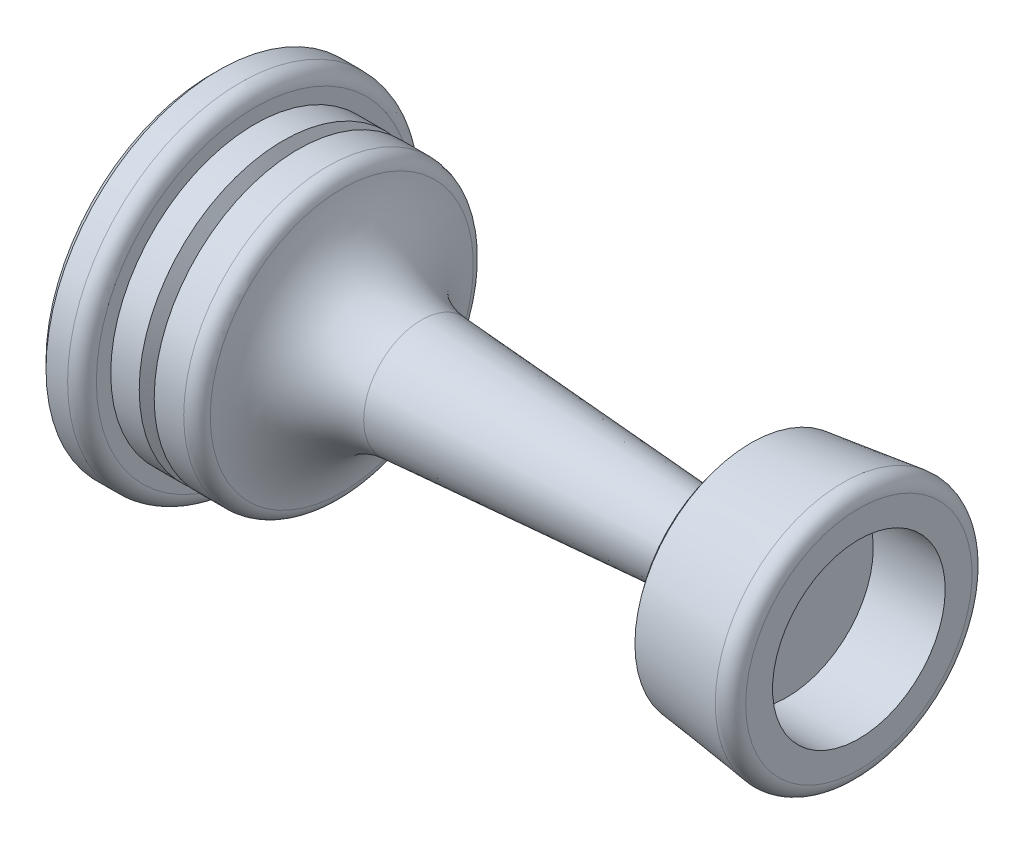
ISO-10303-21;
HEADER;
FILE_DESCRIPTION(('STEP AP214'),'2;1');
FILE_NAME('part.step','',(''),(''),'','','');
FILE_SCHEMA(('AUTOMOTIVE_DESIGN { 1 0 10303 214 1 1 1 1 }'));
ENDSEC;
DATA;
#1=APPLICATION_CONTEXT('core data for automotive mechanical design processes');
#2=APPLICATION_PROTOCOL_DEFINITION('international standard','automotive_design',2000,#1);
#3=PRODUCT_CONTEXT('',#1,'mechanical');
#4=PRODUCT('Part','Part','',(#3));
#5=PRODUCT_RELATED_PRODUCT_CATEGORY('part','',(#4));
#6=PRODUCT_DEFINITION_FORMATION('','',#4);
#7=PRODUCT_DEFINITION_CONTEXT('part definition',#1,'design');
#8=PRODUCT_DEFINITION('design','',#6,#7);
#9=PRODUCT_DEFINITION_SHAPE('','',#8);
#10=(LENGTH_UNIT() NAMED_UNIT(*) SI_UNIT(.MILLI.,.METRE.));
#11=(NAMED_UNIT(*) PLANE_ANGLE_UNIT() SI_UNIT($,.RADIAN.));
#12=(NAMED_UNIT(*) SI_UNIT($,.STERADIAN.) SOLID_ANGLE_UNIT());
#13=UNCERTAINTY_MEASURE_WITH_UNIT(LENGTH_MEASURE(1.E-05),#10,'distance_accuracy_value','');
#14=(GEOMETRIC_REPRESENTATION_CONTEXT(3) GLOBAL_UNCERTAINTY_ASSIGNED_CONTEXT((#13)) GLOBAL_UNIT_ASSIGNED_CONTEXT((#10,
#11,#12)) REPRESENTATION_CONTEXT('',''));
#15=CARTESIAN_POINT('',(0.,0.,0.));
#16=DIRECTION('',(0.,0.,1.));
#17=DIRECTION('',(1.,0.,0.));
#18=AXIS2_PLACEMENT_3D('',#15,#16,#17);
#19=CARTESIAN_POINT('',(0.,0.,0.));
#20=DIRECTION('',(-1.,0.,0.));
#21=DIRECTION('',(0.,0.,1.));
#22=AXIS2_PLACEMENT_3D('',#19,#20,#21);
#23=CYLINDRICAL_SURFACE('',#22,10.);
#24=CARTESIAN_POINT('',(8.07179676972449,0.,0.));
#25=DIRECTION('',(-1.,0.,0.));
#26=DIRECTION('',(0.,0.,1.));
#27=AXIS2_PLACEMENT_3D('',#24,#25,#26);
#28=CIRCLE('',#27,10.);
#29=CARTESIAN_POINT('',(8.07179676972449,0.,10.));
#30=VERTEX_POINT('',#29);
#31=EDGE_CURVE('E61',#30,#30,#28,.T.);
#32=ORIENTED_EDGE('',*,*,#31,.T.);
#33=EDGE_LOOP('',(#32));
#34=FACE_BOUND('',#33,.T.);
#35=CARTESIAN_POINT('',(6.02056705055174,0.,0.));
#36=DIRECTION('',(-1.,0.,0.));
#37=DIRECTION('',(0.,0.,1.));
#38=AXIS2_PLACEMENT_3D('',#35,#36,#37);
#39=CIRCLE('',#38,10.);
#40=CARTESIAN_POINT('',(6.02056705055174,0.,10.));
#41=VERTEX_POINT('',#40);
#42=EDGE_CURVE('E85',#41,#41,#39,.T.);
#43=ORIENTED_EDGE('',*,*,#42,.F.);
#44=EDGE_LOOP('',(#43));
#45=FACE_BOUND('',#44,.T.);
#46=ADVANCED_FACE('F32',(#34,#45),#23,.T.);
#47=CARTESIAN_POINT('',(45.,9.,0.));
#48=DIRECTION('',(-1.,0.,0.));
#49=DIRECTION('',(0.,0.,1.));
#50=AXIS2_PLACEMENT_3D('',#47,#48,#49);
#51=PLANE('',#50);
#52=CARTESIAN_POINT('',(45.,0.,0.));
#53=DIRECTION('',(-1.,0.,0.));
#54=DIRECTION('',(0.,0.,1.));
#55=AXIS2_PLACEMENT_3D('',#52,#53,#54);
#56=CIRCLE('',#55,7.86721778146268);
#57=CARTESIAN_POINT('',(45.,0.,7.86721778146268));
#58=VERTEX_POINT('',#57);
#59=EDGE_CURVE('E43',#58,#58,#56,.F.);
#60=ORIENTED_EDGE('',*,*,#59,.T.);
#61=EDGE_LOOP('',(#60));
#62=FACE_BOUND('',#61,.T.);
#63=CARTESIAN_POINT('',(45.,0.,0.));
#64=DIRECTION('',(1.,0.,0.));
#65=DIRECTION('',(0.,0.,-1.));
#66=AXIS2_PLACEMENT_3D('',#63,#64,#65);
#67=CIRCLE('',#66,6.);
#68=CARTESIAN_POINT('',(45.,0.,-6.));
#69=VERTEX_POINT('',#68);
#70=EDGE_CURVE('E95',#69,#69,#67,.T.);
#71=ORIENTED_EDGE('',*,*,#70,.F.);
#72=EDGE_LOOP('',(#71));
#73=FACE_BOUND('',#72,.T.);
#74=ADVANCED_FACE('F110',(#62,#73),#51,.F.);
#75=CARTESIAN_POINT('',(45.,0.,0.));
#76=DIRECTION('',(1.,0.,0.));
#77=DIRECTION('',(0.,0.,-1.));
#78=AXIS2_PLACEMENT_3D('',#75,#76,#77);
#79=CONICAL_SURFACE('',#78,9.,0.124354994546761);
#80=CARTESIAN_POINT('',(37.4961389383569,0.,0.));
#81=DIRECTION('',(-1.,0.,0.));
#82=DIRECTION('',(0.,0.,1.));
#83=AXIS2_PLACEMENT_3D('',#80,#81,#82);
#84=CIRCLE('',#83,8.06201736729461);
#85=CARTESIAN_POINT('',(37.4961389383569,0.,8.06201736729461));
#86=VERTEX_POINT('',#85);
#87=EDGE_CURVE('E10',#86,#86,#84,.F.);
#88=ORIENTED_EDGE('',*,*,#87,.T.);
#89=EDGE_LOOP('',(#88));
#90=FACE_BOUND('',#89,.T.);
#91=CARTESIAN_POINT('',(43.8759652654108,0.,0.));
#92=DIRECTION('',(-1.,0.,0.));
#93=DIRECTION('',(0.,0.,1.));
#94=AXIS2_PLACEMENT_3D('',#91,#92,#93);
#95=CIRCLE('',#94,8.85949565817635);
#96=CARTESIAN_POINT('',(43.8759652654108,0.,8.85949565817635));
#97=VERTEX_POINT('',#96);
#98=EDGE_CURVE('E47',#97,#97,#95,.T.);
#99=ORIENTED_EDGE('',*,*,#98,.T.);
#100=EDGE_LOOP('',(#99));
#101=FACE_BOUND('',#100,.T.);
#102=ADVANCED_FACE('F112',(#90,#101),#79,.T.);
#103=CARTESIAN_POINT('',(37.,2.5,0.));
#104=DIRECTION('',(1.,0.,0.));
#105=DIRECTION('',(0.,0.,-1.));
#106=AXIS2_PLACEMENT_3D('',#103,#104,#105);
#107=PLANE('',#106);
#108=CARTESIAN_POINT('',(37.,0.,0.));
#109=DIRECTION('',(1.,0.,0.));
#110=DIRECTION('',(0.,0.,-1.));
#111=AXIS2_PLACEMENT_3D('',#108,#109,#110);
#112=CIRCLE('',#111,7.42412444655009);
#113=CARTESIAN_POINT('',(37.,0.,-7.42412444655009));
#114=VERTEX_POINT('',#113);
#115=EDGE_CURVE('E39',#114,#114,#112,.F.);
#116=ORIENTED_EDGE('',*,*,#115,.T.);
#117=EDGE_LOOP('',(#116));
#118=FACE_BOUND('',#117,.T.);
#119=CARTESIAN_POINT('',(37.,0.,0.));
#120=DIRECTION('',(-1.,0.,0.));
#121=DIRECTION('',(0.,0.,1.));
#122=AXIS2_PLACEMENT_3D('',#119,#120,#121);
#123=CIRCLE('',#122,2.5);
#124=CARTESIAN_POINT('',(37.,0.,2.5));
#125=VERTEX_POINT('',#124);
#126=EDGE_CURVE('E52',#125,#125,#123,.T.);
#127=ORIENTED_EDGE('',*,*,#126,.F.);
#128=EDGE_LOOP('',(#127));
#129=FACE_BOUND('',#128,.T.);
#130=ADVANCED_FACE('F119',(#118,#129),#107,.F.);
#131=CARTESIAN_POINT('',(37.,0.,0.));
#132=DIRECTION('',(-1.,0.,0.));
#133=DIRECTION('',(0.,0.,1.));
#134=AXIS2_PLACEMENT_3D('',#131,#132,#133);
#135=CONICAL_SURFACE('',#134,2.5,0.0674576036926157);
#136=CARTESIAN_POINT('',(14.595561275743,0.,0.));
#137=DIRECTION('',(-1.,0.,0.));
#138=DIRECTION('',(0.,0.,1.));
#139=AXIS2_PLACEMENT_3D('',#136,#137,#138);
#140=CIRCLE('',#139,4.01364640884609);
#141=CARTESIAN_POINT('',(14.595561275743,0.,4.01364640884609));
#142=VERTEX_POINT('',#141);
#143=EDGE_CURVE('E55',#142,#142,#140,.T.);
#144=ORIENTED_EDGE('',*,*,#143,.F.);
#145=EDGE_LOOP('',(#144));
#146=FACE_BOUND('',#145,.T.);
#147=ORIENTED_EDGE('',*,*,#126,.T.);
#148=EDGE_LOOP('',(#147));
#149=FACE_BOUND('',#148,.T.);
#150=ADVANCED_FACE('F185',(#146,#149),#135,.T.);
#151=CARTESIAN_POINT('',(15.,0.,0.));
#152=DIRECTION('',(-1.,0.,0.));
#153=DIRECTION('',(0.,0.,1.));
#154=AXIS2_PLACEMENT_3D('',#151,#152,#153);
#155=TOROIDAL_SURFACE('',#154,10.,6.);
#156=CARTESIAN_POINT('',(9.06154008833528,0.,0.));
#157=DIRECTION('',(-1.,0.,0.));
#158=DIRECTION('',(0.,0.,1.));
#159=AXIS2_PLACEMENT_3D('',#156,#157,#158);
#160=CIRCLE('',#159,9.14285714285714);
#161=CARTESIAN_POINT('',(9.06154008833528,0.,9.14285714285714));
#162=VERTEX_POINT('',#161);
#163=EDGE_CURVE('E58',#162,#162,#160,.T.);
#164=ORIENTED_EDGE('',*,*,#163,.F.);
#165=EDGE_LOOP('',(#164));
#166=FACE_BOUND('',#165,.T.);
#167=ORIENTED_EDGE('',*,*,#143,.T.);
#168=EDGE_LOOP('',(#167));
#169=FACE_BOUND('',#168,.T.);
#170=ADVANCED_FACE('F181',(#166,#169),#155,.F.);
#171=CARTESIAN_POINT('',(8.07179676972449,0.,0.));
#172=DIRECTION('',(-1.,0.,0.));
#173=DIRECTION('',(0.,0.,1.));
#174=AXIS2_PLACEMENT_3D('',#171,#172,#173);
#175=TOROIDAL_SURFACE('',#174,9.,1.);
#176=ORIENTED_EDGE('',*,*,#31,.F.);
#177=EDGE_LOOP('',(#176));
#178=FACE_BOUND('',#177,.T.);
#179=ORIENTED_EDGE('',*,*,#163,.T.);
#180=EDGE_LOOP('',(#179));
#181=FACE_BOUND('',#180,.T.);
#182=ADVANCED_FACE('F156',(#178,#181),#175,.T.);
#183=CARTESIAN_POINT('',(4.97943294944826,0.,0.));
#184=DIRECTION('',(-1.,0.,0.));
#185=DIRECTION('',(0.,0.,1.));
#186=AXIS2_PLACEMENT_3D('',#183,#184,#185);
#187=CONICAL_SURFACE('',#186,10.,1.09083078249646);
#188=CARTESIAN_POINT('',(5.5,0.,0.));
#189=DIRECTION('',(-1.,0.,0.));
#190=DIRECTION('',(0.,0.,1.));
#191=AXIS2_PLACEMENT_3D('',#188,#189,#190);
#192=CIRCLE('',#191,9.);
#193=CARTESIAN_POINT('',(5.5,0.,9.));
#194=VERTEX_POINT('',#193);
#195=EDGE_CURVE('E82',#194,#194,#192,.T.);
#196=ORIENTED_EDGE('',*,*,#195,.T.);
#197=EDGE_LOOP('',(#196));
#198=FACE_BOUND('',#197,.T.);
#199=CARTESIAN_POINT('',(4.97943294944826,0.,0.));
#200=DIRECTION('',(-1.,0.,0.));
#201=DIRECTION('',(0.,0.,1.));
#202=AXIS2_PLACEMENT_3D('',#199,#200,#201);
#203=CIRCLE('',#202,10.);
#204=CARTESIAN_POINT('',(4.97943294944826,0.,10.));
#205=VERTEX_POINT('',#204);
#206=EDGE_CURVE('E79',#205,#205,#203,.T.);
#207=ORIENTED_EDGE('',*,*,#206,.F.);
#208=EDGE_LOOP('',(#207));
#209=FACE_BOUND('',#208,.T.);
#210=ADVANCED_FACE('F152',(#198,#209),#187,.T.);
#211=CARTESIAN_POINT('',(5.5,0.,0.));
#212=DIRECTION('',(1.,0.,0.));
#213=DIRECTION('',(0.,0.,-1.));
#214=AXIS2_PLACEMENT_3D('',#211,#212,#213);
#215=CONICAL_SURFACE('',#214,9.,1.09083078249646);
#216=ORIENTED_EDGE('',*,*,#42,.T.);
#217=EDGE_LOOP('',(#216));
#218=FACE_BOUND('',#217,.T.);
#219=ORIENTED_EDGE('',*,*,#195,.F.);
#220=EDGE_LOOP('',(#219));
#221=FACE_BOUND('',#220,.T.);
#222=ADVANCED_FACE('F148',(#218,#221),#215,.T.);
#223=CARTESIAN_POINT('',(0.,0.,0.));
#224=DIRECTION('',(1.,0.,0.));
#225=DIRECTION('',(0.,0.,-1.));
#226=AXIS2_PLACEMENT_3D('',#223,#224,#225);
#227=PLANE('',#226);
#228=CARTESIAN_POINT('',(0.,0.,0.));
#229=DIRECTION('',(-1.,0.,0.));
#230=DIRECTION('',(0.,-1.,0.));
#231=AXIS2_PLACEMENT_3D('',#228,#229,#230);
#232=CIRCLE('',#231,6.);
#233=CARTESIAN_POINT('',(0.,-6.,0.));
#234=VERTEX_POINT('',#233);
#235=EDGE_CURVE('E89',#234,#234,#232,.T.);
#236=ORIENTED_EDGE('',*,*,#235,.F.);
#237=EDGE_LOOP('',(#236));
#238=FACE_BOUND('',#237,.T.);
#239=CARTESIAN_POINT('',(0.,0.,0.));
#240=DIRECTION('',(-1.,0.,0.));
#241=DIRECTION('',(0.,0.,1.));
#242=AXIS2_PLACEMENT_3D('',#239,#240,#241);
#243=CIRCLE('',#242,11.5);
#244=CARTESIAN_POINT('',(0.,0.,11.5));
#245=VERTEX_POINT('',#244);
#246=EDGE_CURVE('E76',#245,#245,#243,.T.);
#247=ORIENTED_EDGE('',*,*,#246,.T.);
#248=EDGE_LOOP('',(#247));
#249=FACE_BOUND('',#248,.T.);
#250=ADVANCED_FACE('F151',(#238,#249),#227,.F.);
#251=CARTESIAN_POINT('',(0.5,0.,0.));
#252=DIRECTION('',(1.,0.,0.));
#253=DIRECTION('',(0.,0.,-1.));
#254=AXIS2_PLACEMENT_3D('',#251,#252,#253);
#255=CONICAL_SURFACE('',#254,12.,0.785398163397449);
#256=ORIENTED_EDGE('',*,*,#246,.F.);
#257=EDGE_LOOP('',(#256));
#258=FACE_BOUND('',#257,.T.);
#259=CARTESIAN_POINT('',(0.5,0.,0.));
#260=DIRECTION('',(-1.,0.,0.));
#261=DIRECTION('',(0.,0.,1.));
#262=AXIS2_PLACEMENT_3D('',#259,#260,#261);
#263=CIRCLE('',#262,12.);
#264=CARTESIAN_POINT('',(0.5,0.,12.));
#265=VERTEX_POINT('',#264);
#266=EDGE_CURVE('E73',#265,#265,#263,.T.);
#267=ORIENTED_EDGE('',*,*,#266,.T.);
#268=EDGE_LOOP('',(#267));
#269=FACE_BOUND('',#268,.T.);
#270=ADVANCED_FACE('F160',(#258,#269),#255,.T.);
#271=CARTESIAN_POINT('',(0.,0.,0.));
#272=DIRECTION('',(-1.,0.,0.));
#273=DIRECTION('',(0.,0.,1.));
#274=AXIS2_PLACEMENT_3D('',#271,#272,#273);
#275=CYLINDRICAL_SURFACE('',#274,12.);
#276=ORIENTED_EDGE('',*,*,#266,.F.);
#277=EDGE_LOOP('',(#276));
#278=FACE_BOUND('',#277,.T.);
#279=CARTESIAN_POINT('',(2.,0.,0.));
#280=DIRECTION('',(-1.,0.,0.));
#281=DIRECTION('',(0.,0.,1.));
#282=AXIS2_PLACEMENT_3D('',#279,#280,#281);
#283=CIRCLE('',#282,12.);
#284=CARTESIAN_POINT('',(2.,0.,12.));
#285=VERTEX_POINT('',#284);
#286=EDGE_CURVE('E70',#285,#285,#283,.T.);
#287=ORIENTED_EDGE('',*,*,#286,.T.);
#288=EDGE_LOOP('',(#287));
#289=FACE_BOUND('',#288,.T.);
#290=ADVANCED_FACE('F164',(#278,#289),#275,.T.);
#291=CARTESIAN_POINT('',(2.,0.,0.));
#292=DIRECTION('',(-1.,0.,0.));
#293=DIRECTION('',(0.,0.,1.));
#294=AXIS2_PLACEMENT_3D('',#291,#292,#293);
#295=TOROIDAL_SURFACE('',#294,11.,1.);
#296=ORIENTED_EDGE('',*,*,#286,.F.);
#297=EDGE_LOOP('',(#296));
#298=FACE_BOUND('',#297,.T.);
#299=CARTESIAN_POINT('',(3.,0.,0.));
#300=DIRECTION('',(-1.,0.,0.));
#301=DIRECTION('',(0.,0.,1.));
#302=AXIS2_PLACEMENT_3D('',#299,#300,#301);
#303=CIRCLE('',#302,11.);
#304=CARTESIAN_POINT('',(3.,0.,11.));
#305=VERTEX_POINT('',#304);
#306=EDGE_CURVE('E67',#305,#305,#303,.T.);
#307=ORIENTED_EDGE('',*,*,#306,.T.);
#308=EDGE_LOOP('',(#307));
#309=FACE_BOUND('',#308,.T.);
#310=ADVANCED_FACE('F168',(#298,#309),#295,.T.);
#311=CARTESIAN_POINT('',(3.,11.,0.));
#312=DIRECTION('',(-1.,0.,0.));
#313=DIRECTION('',(0.,0.,1.));
#314=AXIS2_PLACEMENT_3D('',#311,#312,#313);
#315=PLANE('',#314);
#316=ORIENTED_EDGE('',*,*,#306,.F.);
#317=EDGE_LOOP('',(#316));
#318=FACE_BOUND('',#317,.T.);
#319=CARTESIAN_POINT('',(3.,0.,0.));
#320=DIRECTION('',(-1.,0.,0.));
#321=DIRECTION('',(0.,0.,1.));
#322=AXIS2_PLACEMENT_3D('',#319,#320,#321);
#323=CIRCLE('',#322,10.);
#324=CARTESIAN_POINT('',(3.,0.,10.));
#325=VERTEX_POINT('',#324);
#326=EDGE_CURVE('E64',#325,#325,#323,.T.);
#327=ORIENTED_EDGE('',*,*,#326,.T.);
#328=EDGE_LOOP('',(#327));
#329=FACE_BOUND('',#328,.T.);
#330=ADVANCED_FACE('F172',(#318,#329),#315,.F.);
#331=ORIENTED_EDGE('',*,*,#326,.F.);
#332=EDGE_LOOP('',(#331));
#333=FACE_BOUND('',#332,.T.);
#334=ORIENTED_EDGE('',*,*,#206,.T.);
#335=EDGE_LOOP('',(#334));
#336=FACE_BOUND('',#335,.T.);
#337=ADVANCED_FACE('F123',(#333,#336),#23,.T.);
#338=CARTESIAN_POINT('',(5.,0.,0.));
#339=DIRECTION('',(-1.,0.,0.));
#340=DIRECTION('',(0.,-1.,0.));
#341=AXIS2_PLACEMENT_3D('',#338,#339,#340);
#342=CYLINDRICAL_SURFACE('',#341,6.);
#343=CARTESIAN_POINT('',(5.,0.,0.));
#344=DIRECTION('',(-1.,0.,0.));
#345=DIRECTION('',(0.,-1.,0.));
#346=AXIS2_PLACEMENT_3D('',#343,#344,#345);
#347=CIRCLE('',#346,6.);
#348=CARTESIAN_POINT('',(5.,-6.,0.));
#349=VERTEX_POINT('',#348);
#350=EDGE_CURVE('E88',#349,#349,#347,.T.);
#351=ORIENTED_EDGE('',*,*,#350,.F.);
#352=EDGE_LOOP('',(#351));
#353=FACE_BOUND('',#352,.T.);
#354=ORIENTED_EDGE('',*,*,#235,.T.);
#355=EDGE_LOOP('',(#354));
#356=FACE_BOUND('',#355,.T.);
#357=ADVANCED_FACE('F143',(#353,#356),#342,.F.);
#358=CARTESIAN_POINT('',(5.,0.,0.));
#359=DIRECTION('',(-1.,0.,0.));
#360=DIRECTION('',(0.,-1.,0.));
#361=AXIS2_PLACEMENT_3D('',#358,#359,#360);
#362=PLANE('',#361);
#363=ORIENTED_EDGE('',*,*,#350,.T.);
#364=EDGE_LOOP('',(#363));
#365=FACE_BOUND('',#364,.T.);
#366=ADVANCED_FACE('F106',(#365),#362,.T.);
#367=CARTESIAN_POINT('',(40.,0.,0.));
#368=DIRECTION('',(1.,0.,0.));
#369=DIRECTION('',(0.,0.,-1.));
#370=AXIS2_PLACEMENT_3D('',#367,#368,#369);
#371=CYLINDRICAL_SURFACE('',#370,6.);
#372=CARTESIAN_POINT('',(40.,0.,0.));
#373=DIRECTION('',(1.,0.,0.));
#374=DIRECTION('',(0.,0.,-1.));
#375=AXIS2_PLACEMENT_3D('',#372,#373,#374);
#376=CIRCLE('',#375,6.);
#377=CARTESIAN_POINT('',(40.,0.,-6.));
#378=VERTEX_POINT('',#377);
#379=EDGE_CURVE('E92',#378,#378,#376,.T.);
#380=ORIENTED_EDGE('',*,*,#379,.F.);
#381=EDGE_LOOP('',(#380));
#382=FACE_BOUND('',#381,.T.);
#383=ORIENTED_EDGE('',*,*,#70,.T.);
#384=EDGE_LOOP('',(#383));
#385=FACE_BOUND('',#384,.T.);
#386=ADVANCED_FACE('F103',(#382,#385),#371,.F.);
#387=CARTESIAN_POINT('',(40.,0.,0.));
#388=DIRECTION('',(1.,0.,0.));
#389=DIRECTION('',(0.,0.,-1.));
#390=AXIS2_PLACEMENT_3D('',#387,#388,#389);
#391=PLANE('',#390);
#392=ORIENTED_EDGE('',*,*,#379,.T.);
#393=EDGE_LOOP('',(#392));
#394=FACE_BOUND('',#393,.T.);
#395=ADVANCED_FACE('F101',(#394),#391,.T.);
#396=CARTESIAN_POINT('',(44.,0.,0.));
#397=DIRECTION('',(-1.,0.,0.));
#398=DIRECTION('',(0.,0.,1.));
#399=AXIS2_PLACEMENT_3D('',#396,#397,#398);
#400=TOROIDAL_SURFACE('',#399,7.86721778146268,1.);
#401=ORIENTED_EDGE('',*,*,#59,.F.);
#402=EDGE_LOOP('',(#401));
#403=FACE_BOUND('',#402,.T.);
#404=ORIENTED_EDGE('',*,*,#98,.F.);
#405=EDGE_LOOP('',(#404));
#406=FACE_BOUND('',#405,.T.);
#407=ADVANCED_FACE('F125',(#403,#406),#400,.T.);
#408=CARTESIAN_POINT('',(37.,0.,0.));
#409=DIRECTION('',(1.,0.,0.));
#410=DIRECTION('',(0.,0.,-1.));
#411=AXIS2_PLACEMENT_3D('',#408,#409,#410);
#412=CONICAL_SURFACE('',#411,7.42412444655009,0.909753157944203);
#413=ORIENTED_EDGE('',*,*,#87,.F.);
#414=EDGE_LOOP('',(#413));
#415=FACE_BOUND('',#414,.T.);
#416=ORIENTED_EDGE('',*,*,#115,.F.);
#417=EDGE_LOOP('',(#416));
#418=FACE_BOUND('',#417,.T.);
#419=ADVANCED_FACE('F34',(#415,#418),#412,.T.);
#420=CLOSED_SHELL('',(#46,#74,#102,#130,#150,#170,#182,#210,#222,#250,#270,#290,#310,#330,#337,
#357,#366,#386,#395,#407,#419));
#421=MANIFOLD_SOLID_BREP('B2',#420);
#422=ADVANCED_BREP_SHAPE_REPRESENTATION('',(#18,#421),#14);
#423=SHAPE_DEFINITION_REPRESENTATION(#9,#422);
ENDSEC;
END-ISO-10303-21;
